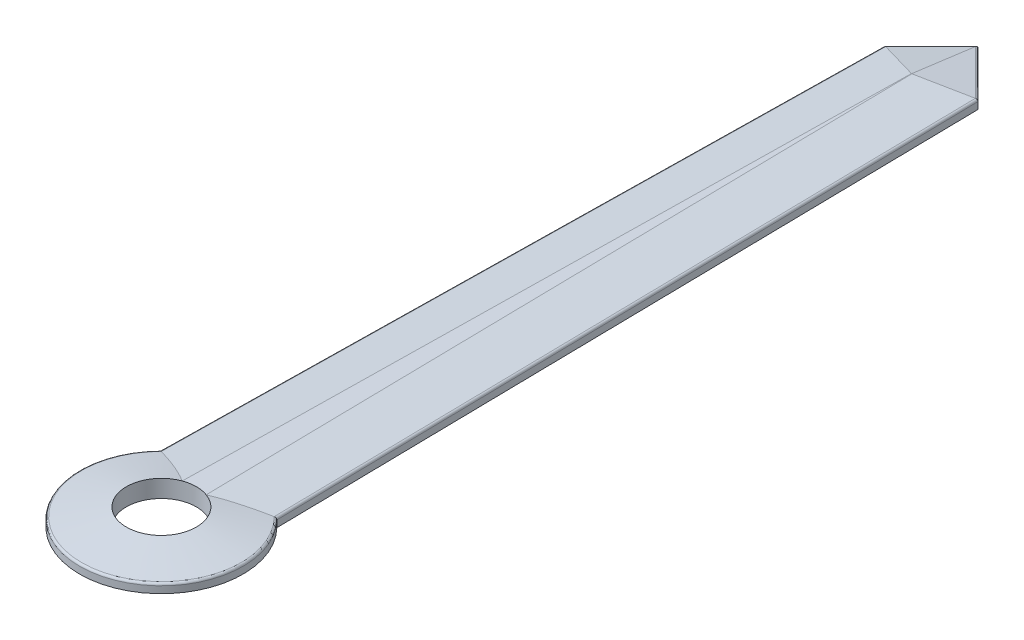
ISO-10303-21;
HEADER;
FILE_DESCRIPTION(('STEP AP214'),'2;1');
FILE_NAME('part.step','',(''),(''),'','','');
FILE_SCHEMA(('AUTOMOTIVE_DESIGN { 1 0 10303 214 1 1 1 1 }'));
ENDSEC;
DATA;
#1=APPLICATION_CONTEXT('core data for automotive mechanical design processes');
#2=APPLICATION_PROTOCOL_DEFINITION('international standard','automotive_design',2000,#1);
#3=PRODUCT_CONTEXT('',#1,'mechanical');
#4=PRODUCT('Part','Part','',(#3));
#5=PRODUCT_RELATED_PRODUCT_CATEGORY('part','',(#4));
#6=PRODUCT_DEFINITION_FORMATION('','',#4);
#7=PRODUCT_DEFINITION_CONTEXT('part definition',#1,'design');
#8=PRODUCT_DEFINITION('design','',#6,#7);
#9=PRODUCT_DEFINITION_SHAPE('','',#8);
#10=(LENGTH_UNIT() NAMED_UNIT(*) SI_UNIT(.MILLI.,.METRE.));
#11=(NAMED_UNIT(*) PLANE_ANGLE_UNIT() SI_UNIT($,.RADIAN.));
#12=(NAMED_UNIT(*) SI_UNIT($,.STERADIAN.) SOLID_ANGLE_UNIT());
#13=UNCERTAINTY_MEASURE_WITH_UNIT(LENGTH_MEASURE(1.E-05),#10,'distance_accuracy_value','');
#14=(GEOMETRIC_REPRESENTATION_CONTEXT(3) GLOBAL_UNCERTAINTY_ASSIGNED_CONTEXT((#13)) GLOBAL_UNIT_ASSIGNED_CONTEXT((#10,
#11,#12)) REPRESENTATION_CONTEXT('',''));
#15=CARTESIAN_POINT('',(0.,0.,0.));
#16=DIRECTION('',(0.,0.,1.));
#17=DIRECTION('',(1.,0.,0.));
#18=AXIS2_PLACEMENT_3D('',#15,#16,#17);
#19=CARTESIAN_POINT('',(0.,0.1905,0.));
#20=DIRECTION('',(0.,1.,0.));
#21=DIRECTION('',(0.,0.,1.));
#22=AXIS2_PLACEMENT_3D('',#19,#20,#21);
#23=PLANE('',#22);
#24=CARTESIAN_POINT('',(0.,0.1905,0.));
#25=DIRECTION('',(0.,1.,0.));
#26=DIRECTION('',(0.,0.,1.));
#27=AXIS2_PLACEMENT_3D('',#24,#25,#26);
#28=CIRCLE('',#27,0.380999999999999);
#29=CARTESIAN_POINT('',(0.130290982169233,0.1905,-0.358029691457812));
#30=VERTEX_POINT('',#29);
#31=CARTESIAN_POINT('',(-0.130290982169233,0.1905,-0.358029691457812));
#32=VERTEX_POINT('',#31);
#33=EDGE_CURVE('E149',#30,#32,#28,.T.);
#34=ORIENTED_EDGE('',*,*,#33,.F.);
#35=DIRECTION('',(-0.0163641472754282,0.,-0.999866098377152));
#36=VECTOR('',#35,1.);
#37=CARTESIAN_POINT('',(-0.000895722754283927,0.1905,-8.37367124021056));
#38=LINE('',#37,#36);
#39=CARTESIAN_POINT('',(0.00247458824657965,0.1905,-8.16774179860675));
#40=VERTEX_POINT('',#39);
#41=EDGE_CURVE('E181',#30,#40,#38,.T.);
#42=ORIENTED_EDGE('',*,*,#41,.T.);
#43=DIRECTION('',(-0.707106781186548,0.,-0.707106781186547));
#44=VECTOR('',#43,1.);
#45=CARTESIAN_POINT('',(-0.359891806573333,0.1905,-8.53010819342667));
#46=LINE('',#45,#44);
#47=CARTESIAN_POINT('',(0.,0.1905,-8.17021638685333));
#48=VERTEX_POINT('',#47);
#49=EDGE_CURVE('E178',#40,#48,#46,.T.);
#50=ORIENTED_EDGE('',*,*,#49,.T.);
#51=DIRECTION('',(-0.707106781186548,0.,0.707106781186547));
#52=VECTOR('',#51,1.);
#53=CARTESIAN_POINT('',(-0.148108193426666,0.1905,-8.02210819342667));
#54=LINE('',#53,#52);
#55=CARTESIAN_POINT('',(-0.00247458824657978,0.1905,-8.16774179860675));
#56=VERTEX_POINT('',#55);
#57=EDGE_CURVE('E176',#48,#56,#54,.T.);
#58=ORIENTED_EDGE('',*,*,#57,.T.);
#59=DIRECTION('',(-0.0163641472754282,0.,0.999866098377152));
#60=VECTOR('',#59,1.);
#61=CARTESIAN_POINT('',(-0.126104277245716,0.1905,-0.613841634877489));
#62=LINE('',#61,#60);
#63=EDGE_CURVE('E174',#56,#32,#62,.T.);
#64=ORIENTED_EDGE('',*,*,#63,.T.);
#65=EDGE_LOOP('',(#34,#42,#50,#58,#64));
#66=FACE_BOUND('',#65,.T.);
#67=ADVANCED_FACE('F34',(#66),#23,.T.);
#68=CARTESIAN_POINT('',(0.,0.,0.));
#69=DIRECTION('',(0.,1.,0.));
#70=DIRECTION('',(0.,0.,1.));
#71=AXIS2_PLACEMENT_3D('',#68,#69,#70);
#72=PLANE('',#71);
#73=CARTESIAN_POINT('',(0.,0.,0.));
#74=DIRECTION('',(0.,1.,0.));
#75=DIRECTION('',(0.,0.,1.));
#76=AXIS2_PLACEMENT_3D('',#73,#74,#75);
#77=CIRCLE('',#76,0.889);
#78=CARTESIAN_POINT('',(-0.635,0.,-0.622170394666927));
#79=VERTEX_POINT('',#78);
#80=CARTESIAN_POINT('',(0.635,0.,-0.622170394666927));
#81=VERTEX_POINT('',#80);
#82=EDGE_CURVE('E141',#79,#81,#77,.T.);
#83=ORIENTED_EDGE('',*,*,#82,.F.);
#84=DIRECTION('',(-0.0163641472754282,0.,0.999866098377152));
#85=VECTOR('',#84,1.);
#86=CARTESIAN_POINT('',(-0.635,0.,-0.622170394666927));
#87=LINE('',#86,#85);
#88=CARTESIAN_POINT('',(-0.508,0.,-8.382));
#89=VERTEX_POINT('',#88);
#90=EDGE_CURVE('E160',#89,#79,#87,.T.);
#91=ORIENTED_EDGE('',*,*,#90,.F.);
#92=DIRECTION('',(-0.707106781186548,0.,0.707106781186547));
#93=VECTOR('',#92,1.);
#94=CARTESIAN_POINT('',(-0.508,0.,-8.382));
#95=LINE('',#94,#93);
#96=CARTESIAN_POINT('',(0.,0.,-8.89));
#97=VERTEX_POINT('',#96);
#98=EDGE_CURVE('E157',#97,#89,#95,.T.);
#99=ORIENTED_EDGE('',*,*,#98,.F.);
#100=DIRECTION('',(-0.707106781186548,0.,-0.707106781186547));
#101=VECTOR('',#100,1.);
#102=CARTESIAN_POINT('',(0.,0.,-8.89));
#103=LINE('',#102,#101);
#104=CARTESIAN_POINT('',(0.508,0.,-8.382));
#105=VERTEX_POINT('',#104);
#106=EDGE_CURVE('E144',#105,#97,#103,.T.);
#107=ORIENTED_EDGE('',*,*,#106,.F.);
#108=DIRECTION('',(-0.0163641472754282,0.,-0.999866098377152));
#109=VECTOR('',#108,1.);
#110=CARTESIAN_POINT('',(0.508,0.,-8.382));
#111=LINE('',#110,#109);
#112=EDGE_CURVE('E128',#81,#105,#111,.T.);
#113=ORIENTED_EDGE('',*,*,#112,.F.);
#114=EDGE_LOOP('',(#83,#91,#99,#107,#113));
#115=FACE_BOUND('',#114,.T.);
#116=CARTESIAN_POINT('',(0.,0.,0.));
#117=DIRECTION('',(0.,1.,0.));
#118=DIRECTION('',(0.,0.,1.));
#119=AXIS2_PLACEMENT_3D('',#116,#117,#118);
#120=CIRCLE('',#119,0.380999999999999);
#121=CARTESIAN_POINT('',(0.,0.,0.380999999999999));
#122=VERTEX_POINT('',#121);
#123=EDGE_CURVE('E152',#122,#122,#120,.T.);
#124=ORIENTED_EDGE('',*,*,#123,.T.);
#125=EDGE_LOOP('',(#124));
#126=FACE_BOUND('',#125,.T.);
#127=ADVANCED_FACE('F138',(#115,#126),#72,.F.);
#128=CARTESIAN_POINT('',(0.,0.1905,0.));
#129=DIRECTION('',(0.,-1.,0.));
#130=DIRECTION('',(0.,0.,-1.));
#131=AXIS2_PLACEMENT_3D('',#128,#129,#130);
#132=CYLINDRICAL_SURFACE('',#131,0.889);
#133=DIRECTION('',(0.,-1.,0.));
#134=VECTOR('',#133,1.);
#135=CARTESIAN_POINT('',(0.635,0.1905,-0.622170394666927));
#136=LINE('',#135,#134);
#137=CARTESIAN_POINT('',(0.635,0.0741625137147924,-0.622170394666927));
#138=VERTEX_POINT('',#137);
#139=EDGE_CURVE('E124',#138,#81,#136,.T.);
#140=ORIENTED_EDGE('',*,*,#139,.F.);
#141=CARTESIAN_POINT('',(0.,0.0741625137147923,0.));
#142=DIRECTION('',(0.,1.,0.));
#143=DIRECTION('',(0.,0.,1.));
#144=AXIS2_PLACEMENT_3D('',#141,#142,#143);
#145=CIRCLE('',#144,0.889);
#146=CARTESIAN_POINT('',(-0.635,0.0741625137147924,-0.622170394666927));
#147=VERTEX_POINT('',#146);
#148=EDGE_CURVE('E48',#138,#147,#145,.F.);
#149=ORIENTED_EDGE('',*,*,#148,.T.);
#150=DIRECTION('',(0.,-1.,0.));
#151=VECTOR('',#150,1.);
#152=CARTESIAN_POINT('',(-0.635,0.1905,-0.622170394666927));
#153=LINE('',#152,#151);
#154=EDGE_CURVE('E147',#147,#79,#153,.T.);
#155=ORIENTED_EDGE('',*,*,#154,.T.);
#156=ORIENTED_EDGE('',*,*,#82,.T.);
#157=EDGE_LOOP('',(#140,#149,#155,#156));
#158=FACE_BOUND('',#157,.T.);
#159=ADVANCED_FACE('F146',(#158),#132,.T.);
#160=CARTESIAN_POINT('',(0.508,0.1905,-8.382));
#161=DIRECTION('',(-0.999866098377152,0.,0.0163641472754282));
#162=DIRECTION('',(0.0163641472754282,0.,0.999866098377152));
#163=AXIS2_PLACEMENT_3D('',#160,#161,#162);
#164=PLANE('',#163);
#165=DIRECTION('',(0.,-1.,0.));
#166=VECTOR('',#165,1.);
#167=CARTESIAN_POINT('',(0.508,0.1905,-8.382));
#168=LINE('',#167,#166);
#169=CARTESIAN_POINT('',(0.508,0.0741625137147924,-8.382));
#170=VERTEX_POINT('',#169);
#171=EDGE_CURVE('E134',#170,#105,#168,.T.);
#172=ORIENTED_EDGE('',*,*,#171,.F.);
#173=DIRECTION('',(0.0163641472754282,0.,0.999866098377152));
#174=VECTOR('',#173,1.);
#175=CARTESIAN_POINT('',(0.635,0.0741625137147924,-0.622170394666927));
#176=LINE('',#175,#174);
#177=EDGE_CURVE('E131',#170,#138,#176,.T.);
#178=ORIENTED_EDGE('',*,*,#177,.T.);
#179=ORIENTED_EDGE('',*,*,#139,.T.);
#180=ORIENTED_EDGE('',*,*,#112,.T.);
#181=EDGE_LOOP('',(#172,#178,#179,#180));
#182=FACE_BOUND('',#181,.T.);
#183=ADVANCED_FACE('F127',(#182),#164,.F.);
#184=CARTESIAN_POINT('',(0.,0.1905,-8.89));
#185=DIRECTION('',(-0.707106781186547,0.,0.707106781186548));
#186=DIRECTION('',(0.707106781186548,0.,0.707106781186547));
#187=AXIS2_PLACEMENT_3D('',#184,#185,#186);
#188=PLANE('',#187);
#189=DIRECTION('',(0.,-1.,0.));
#190=VECTOR('',#189,1.);
#191=CARTESIAN_POINT('',(0.,0.1905,-8.89));
#192=LINE('',#191,#190);
#193=CARTESIAN_POINT('',(0.,0.0741625137147924,-8.89));
#194=VERTEX_POINT('',#193);
#195=EDGE_CURVE('E165',#194,#97,#192,.T.);
#196=ORIENTED_EDGE('',*,*,#195,.F.);
#197=DIRECTION('',(0.707106781186548,0.,0.707106781186547));
#198=VECTOR('',#197,1.);
#199=CARTESIAN_POINT('',(0.508,0.0741625137147922,-8.382));
#200=LINE('',#199,#198);
#201=EDGE_CURVE('E184',#194,#170,#200,.T.);
#202=ORIENTED_EDGE('',*,*,#201,.T.);
#203=ORIENTED_EDGE('',*,*,#171,.T.);
#204=ORIENTED_EDGE('',*,*,#106,.T.);
#205=EDGE_LOOP('',(#196,#202,#203,#204));
#206=FACE_BOUND('',#205,.T.);
#207=ADVANCED_FACE('F290',(#206),#188,.F.);
#208=CARTESIAN_POINT('',(-0.508,0.1905,-8.382));
#209=DIRECTION('',(0.707106781186547,0.,0.707106781186548));
#210=DIRECTION('',(0.707106781186548,0.,-0.707106781186547));
#211=AXIS2_PLACEMENT_3D('',#208,#209,#210);
#212=PLANE('',#211);
#213=DIRECTION('',(0.,-1.,0.));
#214=VECTOR('',#213,1.);
#215=CARTESIAN_POINT('',(-0.508,0.1905,-8.382));
#216=LINE('',#215,#214);
#217=CARTESIAN_POINT('',(-0.508,0.0741625137147924,-8.382));
#218=VERTEX_POINT('',#217);
#219=EDGE_CURVE('E163',#218,#89,#216,.T.);
#220=ORIENTED_EDGE('',*,*,#219,.F.);
#221=DIRECTION('',(0.707106781186548,0.,-0.707106781186547));
#222=VECTOR('',#221,1.);
#223=CARTESIAN_POINT('',(0.,0.0741625137147922,-8.89));
#224=LINE('',#223,#222);
#225=EDGE_CURVE('E272',#218,#194,#224,.T.);
#226=ORIENTED_EDGE('',*,*,#225,.T.);
#227=ORIENTED_EDGE('',*,*,#195,.T.);
#228=ORIENTED_EDGE('',*,*,#98,.T.);
#229=EDGE_LOOP('',(#220,#226,#227,#228));
#230=FACE_BOUND('',#229,.T.);
#231=ADVANCED_FACE('F288',(#230),#212,.F.);
#232=CARTESIAN_POINT('',(-0.635,0.1905,-0.622170394666927));
#233=DIRECTION('',(0.999866098377152,0.,0.0163641472754282));
#234=DIRECTION('',(0.0163641472754282,0.,-0.999866098377152));
#235=AXIS2_PLACEMENT_3D('',#232,#233,#234);
#236=PLANE('',#235);
#237=ORIENTED_EDGE('',*,*,#154,.F.);
#238=DIRECTION('',(0.0163641472754282,0.,-0.999866098377152));
#239=VECTOR('',#238,1.);
#240=CARTESIAN_POINT('',(-0.508,0.0741625137147924,-8.382));
#241=LINE('',#240,#239);
#242=EDGE_CURVE('E252',#147,#218,#241,.T.);
#243=ORIENTED_EDGE('',*,*,#242,.T.);
#244=ORIENTED_EDGE('',*,*,#219,.T.);
#245=ORIENTED_EDGE('',*,*,#90,.T.);
#246=EDGE_LOOP('',(#237,#243,#244,#245));
#247=FACE_BOUND('',#246,.T.);
#248=ADVANCED_FACE('F291',(#247),#236,.F.);
#249=CARTESIAN_POINT('',(0.,0.1905,0.));
#250=DIRECTION('',(0.,-1.,0.));
#251=DIRECTION('',(0.,0.,-1.));
#252=AXIS2_PLACEMENT_3D('',#249,#250,#251);
#253=CYLINDRICAL_SURFACE('',#252,0.380999999999999);
#254=CARTESIAN_POINT('',(0.,0.190319615913308,0.));
#255=DIRECTION('',(0.,-1.,0.));
#256=DIRECTION('',(0.,0.,-1.));
#257=AXIS2_PLACEMENT_3D('',#254,#255,#256);
#258=CIRCLE('',#257,0.380999999999999);
#259=CARTESIAN_POINT('',(-0.131260785505618,0.190319615913316,-0.357675280370964));
#260=VERTEX_POINT('',#259);
#261=CARTESIAN_POINT('',(0.131260785505618,0.190319615913308,-0.357675280370964));
#262=VERTEX_POINT('',#261);
#263=EDGE_CURVE('E169',#260,#262,#258,.F.);
#264=ORIENTED_EDGE('',*,*,#263,.T.);
#265=CARTESIAN_POINT('',(0.,0.215976483675146,0.));
#266=DIRECTION('',(0.183926719228348,0.982935349149554,-0.00301020699294048));
#267=DIRECTION('',(0.982803732511148,-0.18395135061272,-0.0160848988157077));
#268=AXIS2_PLACEMENT_3D('',#265,#266,#267);
#269=ELLIPSE('',#268,0.387614506213094,0.380999999999999);
#270=EDGE_CURVE('E172',#262,#30,#269,.T.);
#271=ORIENTED_EDGE('',*,*,#270,.T.);
#272=ORIENTED_EDGE('',*,*,#33,.T.);
#273=CARTESIAN_POINT('',(0.,0.215976483675146,0.));
#274=DIRECTION('',(-0.183926719228348,0.982935349149554,-0.00301020699294048));
#275=DIRECTION('',(-0.982803732511148,-0.18395135061272,-0.0160848988157078));
#276=AXIS2_PLACEMENT_3D('',#273,#274,#275);
#277=ELLIPSE('',#276,0.387614506213094,0.380999999999999);
#278=EDGE_CURVE('E133',#32,#260,#277,.T.);
#279=ORIENTED_EDGE('',*,*,#278,.T.);
#280=EDGE_LOOP('',(#264,#271,#272,#279));
#281=FACE_BOUND('',#280,.T.);
#282=ORIENTED_EDGE('',*,*,#123,.F.);
#283=EDGE_LOOP('',(#282));
#284=FACE_BOUND('',#283,.T.);
#285=ADVANCED_FACE('F217',(#281,#284),#253,.F.);
#286=CARTESIAN_POINT('',(-4.08510819342667,0.1905,-4.08510819342667));
#287=DIRECTION('',(-0.130073247426679,0.982935349149554,-0.130073247426679));
#288=DIRECTION('',(0.,0.13118776787575,0.991357538711326));
#289=AXIS2_PLACEMENT_3D('',#286,#287,#288);
#290=PLANE('',#289);
#291=DIRECTION('',(0.,-0.13118776787575,-0.991357538711326));
#292=VECTOR('',#291,1.);
#293=CARTESIAN_POINT('',(0.,0.721784590194362,-4.15541384680878));
#294=LINE('',#293,#292);
#295=CARTESIAN_POINT('',(0.,0.099129071583191,-8.860686696485));
#296=VERTEX_POINT('',#295);
#297=EDGE_CURVE('E276',#296,#48,#294,.F.);
#298=ORIENTED_EDGE('',*,*,#297,.F.);
#299=DIRECTION('',(0.707106781186548,0.,-0.707106781186547));
#300=VECTOR('',#299,1.);
#301=CARTESIAN_POINT('',(-0.493343348242499,0.0991290715831909,-8.3673433482425));
#302=LINE('',#301,#300);
#303=CARTESIAN_POINT('',(-0.487412396227678,0.0991290715831911,-8.37327430025732));
#304=VERTEX_POINT('',#303);
#305=EDGE_CURVE('E269',#296,#304,#302,.F.);
#306=ORIENTED_EDGE('',*,*,#305,.T.);
#307=DIRECTION('',(-0.907167863131854,-0.170926598256659,-0.384487406957877));
#308=VECTOR('',#307,1.);
#309=CARTESIAN_POINT('',(2.73563364095255,0.706408404933815,-7.00724198837286));
#310=LINE('',#309,#308);
#311=EDGE_CURVE('E280',#56,#304,#310,.T.);
#312=ORIENTED_EDGE('',*,*,#311,.F.);
#313=ORIENTED_EDGE('',*,*,#57,.F.);
#314=EDGE_LOOP('',(#298,#306,#312,#313));
#315=FACE_BOUND('',#314,.T.);
#316=ADVANCED_FACE('F213',(#315),#290,.T.);
#317=CARTESIAN_POINT('',(4.08510819342667,0.1905,-4.08510819342667));
#318=DIRECTION('',(0.130073247426679,0.982935349149554,-0.130073247426679));
#319=DIRECTION('',(0.,0.13118776787575,0.991357538711326));
#320=AXIS2_PLACEMENT_3D('',#317,#318,#319);
#321=PLANE('',#320);
#322=DIRECTION('',(0.907167863131854,-0.170926598256659,-0.384487406957878));
#323=VECTOR('',#322,1.);
#324=CARTESIAN_POINT('',(1.93829169872956,-0.174242455050791,-8.98820439588696));
#325=LINE('',#324,#323);
#326=CARTESIAN_POINT('',(0.487412396227678,0.099129071583191,-8.37327430025732));
#327=VERTEX_POINT('',#326);
#328=EDGE_CURVE('E277',#327,#40,#325,.F.);
#329=ORIENTED_EDGE('',*,*,#328,.F.);
#330=DIRECTION('',(0.707106781186548,0.,0.707106781186547));
#331=VECTOR('',#330,1.);
#332=CARTESIAN_POINT('',(-0.0146566517575008,0.0991290715831909,-8.8753433482425));
#333=LINE('',#332,#331);
#334=EDGE_CURVE('E267',#327,#296,#333,.F.);
#335=ORIENTED_EDGE('',*,*,#334,.T.);
#336=ORIENTED_EDGE('',*,*,#297,.T.);
#337=ORIENTED_EDGE('',*,*,#49,.F.);
#338=EDGE_LOOP('',(#329,#335,#336,#337));
#339=FACE_BOUND('',#338,.T.);
#340=ADVANCED_FACE('F210',(#339),#321,.T.);
#341=CARTESIAN_POINT('',(-0.136114158247782,0.1905,-0.00222769042320052));
#342=DIRECTION('',(-0.183926719228348,0.982935349149554,-0.00301020699294048));
#343=DIRECTION('',(-0.982939802538536,-0.183927552545845,0.));
#344=AXIS2_PLACEMENT_3D('',#341,#342,#343);
#345=PLANE('',#344);
#346=ORIENTED_EDGE('',*,*,#311,.T.);
#347=DIRECTION('',(0.0163641472754282,0.,-0.999866098377152));
#348=VECTOR('',#347,1.);
#349=CARTESIAN_POINT('',(-0.61427513976962,0.0991290715831911,-0.621831204583752));
#350=LINE('',#349,#348);
#351=CARTESIAN_POINT('',(-0.61441131251624,0.0991290715831926,-0.613510910798519));
#352=VERTEX_POINT('',#351);
#353=EDGE_CURVE('E56',#304,#352,#350,.F.);
#354=ORIENTED_EDGE('',*,*,#353,.T.);
#355=CARTESIAN_POINT('',(-1.47147255137392,-0.0621517655911384,-0.909893903828372));
#356=CARTESIAN_POINT('',(-1.40126561664907,-0.0489516430604869,-0.88931861528272));
#357=CARTESIAN_POINT('',(-1.33123256726205,-0.0357822712731719,-0.868159922647089));
#358=CARTESIAN_POINT('',(-1.19155517359173,-0.00951179945482843,-0.824385318027376));
#359=CARTESIAN_POINT('',(-1.12191114060924,0.00358924546163034,-0.801768382035371));
#360=CARTESIAN_POINT('',(-0.91180737219843,0.0431215576781161,-0.730673507034872));
#361=CARTESIAN_POINT('',(-0.772172257976581,0.0694067199513363,-0.679518649929991));
#362=CARTESIAN_POINT('',(-0.560869877669018,0.109216129447022,-0.591178463493681));
#363=CARTESIAN_POINT('',(-0.487459031921342,0.123053207294985,-0.558377751854708));
#364=CARTESIAN_POINT('',(-0.343527602704058,0.150202761355517,-0.487478697250913));
#365=CARTESIAN_POINT('',(-0.272995184279456,0.163517374645867,-0.449405653260168));
#366=CARTESIAN_POINT('',(-0.149537241978278,0.186855719724566,-0.372045498655669));
#367=CARTESIAN_POINT('',(-0.0957633088371803,0.197033555626133,-0.334276805966505));
#368=CARTESIAN_POINT('',(-0.021155913531705,0.211192563180673,-0.2694654537962));
#369=CARTESIAN_POINT('',(0.00286274626934901,0.215757892030189,-0.246294353145887));
#370=CARTESIAN_POINT('',(0.046850909684194,0.224142164765649,-0.196264748147143));
#371=CARTESIAN_POINT('',(0.0668457581203295,0.227965774640298,-0.169431233703665));
#372=CARTESIAN_POINT('',(0.0904704545488148,0.232515842293267,-0.127171870621056));
#373=CARTESIAN_POINT('',(0.0970812378010598,0.233794733459666,-0.113495847626509));
#374=CARTESIAN_POINT('',(0.108231955058883,0.23596765023619,-0.0852845424472507));
#375=CARTESIAN_POINT('',(0.112773698416452,0.236862012074228,-0.0707500236230778));
#376=CARTESIAN_POINT('',(0.119326509505099,0.23817953496342,-0.0409172659247494));
#377=CARTESIAN_POINT('',(0.121310138991908,0.238597581619502,-0.0256125469164558));
#378=CARTESIAN_POINT('',(0.122346333093547,0.23888548850571,0.0050863632700086));
#379=CARTESIAN_POINT('',(0.121403083838638,0.238756131556419,0.0204803952626585));
#380=CARTESIAN_POINT('',(0.116963744366099,0.238013338117826,0.0491811513962582));
#381=CARTESIAN_POINT('',(0.113750978057984,0.237453062228181,0.0625352461760626));
#382=CARTESIAN_POINT('',(0.105382207931775,0.235967093264305,0.0886560448923355));
#383=CARTESIAN_POINT('',(0.100217020058462,0.235039672173734,0.101419647647132));
#384=CARTESIAN_POINT('',(0.0846088482750408,0.2322186806122,0.133944820840169));
#385=CARTESIAN_POINT('',(0.0728899550909656,0.230084371444411,0.153056346869973));
#386=CARTESIAN_POINT('',(0.04690333013583,0.225331855140782,0.189006831279379));
#387=CARTESIAN_POINT('',(0.0326746133775238,0.222721036354855,0.205874481043181));
#388=CARTESIAN_POINT('',(0.017766486995649,0.219980200210557,0.221799645962157));
#389=B_SPLINE_CURVE_WITH_KNOTS('',3,(#355,#356,#357,#358,#359,#360,#361,#362,#363,#364,#365,
#366,#367,#368,#369,#370,#371,#372,#373,#374,#375,#376,#377,#378,#379,#380,#381,#382,#383,#384,
#385,#386,#387,#388),.UNSPECIFIED.,.F.,.F.,(4,2,2,2,2,2,2,2,2,2,2,2,2,2,2,2,4),(0.,
0.223001286945015,0.446160912348124,0.898804041303776,1.14341976037625,1.38689994820208,
1.58548346483561,1.68631638916805,1.78649281752304,1.83209118392024,1.87764959815471,
1.9236927138026,1.96967000725155,2.01073823503396,2.05200209870585,2.11922986502013,
2.18549230719106),.UNSPECIFIED.);
#390=EDGE_CURVE('E192',#260,#352,#389,.F.);
#391=ORIENTED_EDGE('',*,*,#390,.F.);
#392=ORIENTED_EDGE('',*,*,#278,.F.);
#393=ORIENTED_EDGE('',*,*,#63,.F.);
#394=EDGE_LOOP('',(#346,#354,#391,#392,#393));
#395=FACE_BOUND('',#394,.T.);
#396=ADVANCED_FACE('F205',(#395),#345,.T.);
#397=CARTESIAN_POINT('',(0.136114158247782,0.1905,-0.00222769042320051));
#398=DIRECTION('',(0.183926719228348,0.982935349149554,-0.00301020699294048));
#399=DIRECTION('',(-0.982939802538536,0.183927552545845,0.));
#400=AXIS2_PLACEMENT_3D('',#397,#398,#399);
#401=PLANE('',#400);
#402=CARTESIAN_POINT('',(1.47147255137392,-0.0621517655911384,-0.909893903828373));
#403=CARTESIAN_POINT('',(1.40126561664907,-0.0489516430604868,-0.88931861528272));
#404=CARTESIAN_POINT('',(1.33123256726205,-0.0357822712731718,-0.868159922647089));
#405=CARTESIAN_POINT('',(1.19155517359173,-0.0095117994548283,-0.824385318027376));
#406=CARTESIAN_POINT('',(1.12191114060923,0.00358924546163044,-0.801768382035371));
#407=CARTESIAN_POINT('',(0.91180737219843,0.0431215576781161,-0.730673507034872));
#408=CARTESIAN_POINT('',(0.772172257976581,0.0694067199513363,-0.679518649929991));
#409=CARTESIAN_POINT('',(0.560869877669018,0.109216129447022,-0.591178463493681));
#410=CARTESIAN_POINT('',(0.487459031921342,0.123053207294985,-0.558377751854708));
#411=CARTESIAN_POINT('',(0.343527602704058,0.150202761355517,-0.487478697250913));
#412=CARTESIAN_POINT('',(0.272995184279456,0.163517374645867,-0.449405653260168));
#413=CARTESIAN_POINT('',(0.149537241978278,0.186855719724566,-0.372045498655669));
#414=CARTESIAN_POINT('',(0.0957633088371803,0.197033555626133,-0.334276805966505));
#415=CARTESIAN_POINT('',(0.021155913531705,0.211192563180673,-0.2694654537962));
#416=CARTESIAN_POINT('',(-0.00286274626934911,0.215757892030189,-0.246294353145887));
#417=CARTESIAN_POINT('',(-0.0468509096841942,0.224142164765649,-0.196264748147143));
#418=CARTESIAN_POINT('',(-0.0668457581203296,0.227965774640298,-0.169431233703665));
#419=CARTESIAN_POINT('',(-0.0904704545488149,0.232515842293267,-0.127171870621056));
#420=CARTESIAN_POINT('',(-0.0970812378010599,0.233794733459666,-0.113495847626509));
#421=CARTESIAN_POINT('',(-0.108231955058884,0.23596765023619,-0.0852845424472503));
#422=CARTESIAN_POINT('',(-0.112773698416452,0.236862012074228,-0.0707500236230774));
#423=CARTESIAN_POINT('',(-0.119326509505099,0.23817953496342,-0.0409172659247491));
#424=CARTESIAN_POINT('',(-0.121310138991908,0.238597581619502,-0.0256125469164555));
#425=CARTESIAN_POINT('',(-0.122346333093547,0.23888548850571,0.0050863632700088));
#426=CARTESIAN_POINT('',(-0.121403083838638,0.238756131556419,0.0204803952626587));
#427=CARTESIAN_POINT('',(-0.116963744366099,0.238013338117826,0.0491811513962584));
#428=CARTESIAN_POINT('',(-0.113750978057984,0.237453062228181,0.0625352461760627));
#429=CARTESIAN_POINT('',(-0.105382207931775,0.235967093264305,0.0886560448923356));
#430=CARTESIAN_POINT('',(-0.100217020058462,0.235039672173734,0.101419647647132));
#431=CARTESIAN_POINT('',(-0.0846088482750408,0.2322186806122,0.133944820840169));
#432=CARTESIAN_POINT('',(-0.0728899550909655,0.230084371444411,0.153056346869973));
#433=CARTESIAN_POINT('',(-0.04690333013583,0.225331855140782,0.189006831279379));
#434=CARTESIAN_POINT('',(-0.0326746133775237,0.222721036354855,0.205874481043181));
#435=CARTESIAN_POINT('',(-0.017766486995649,0.219980200210557,0.221799645962157));
#436=B_SPLINE_CURVE_WITH_KNOTS('',3,(#402,#403,#404,#405,#406,#407,#408,#409,#410,#411,#412,
#413,#414,#415,#416,#417,#418,#419,#420,#421,#422,#423,#424,#425,#426,#427,#428,#429,#430,#431,
#432,#433,#434,#435),.UNSPECIFIED.,.F.,.F.,(4,2,2,2,2,2,2,2,2,2,2,2,2,2,2,2,4),(0.,
0.223001286945015,0.446160912348125,0.898804041303776,1.14341976037625,1.38689994820208,
1.58548346483561,1.68631638916805,1.78649281752304,1.83209118392024,1.87764959815471,
1.9236927138026,1.96967000725155,2.01073823503396,2.05200209870585,2.11922986502013,
2.18549230719106),.UNSPECIFIED.);
#437=CARTESIAN_POINT('',(0.614411312516249,0.099129071583191,-0.613510910798523));
#438=VERTEX_POINT('',#437);
#439=EDGE_CURVE('E185',#438,#262,#436,.T.);
#440=ORIENTED_EDGE('',*,*,#439,.F.);
#441=DIRECTION('',(0.0163641472754282,0.,0.999866098377152));
#442=VECTOR('',#441,1.);
#443=CARTESIAN_POINT('',(0.487275139769621,0.0991290715831911,-8.38166080991682));
#444=LINE('',#443,#442);
#445=EDGE_CURVE('E255',#438,#327,#444,.F.);
#446=ORIENTED_EDGE('',*,*,#445,.T.);
#447=ORIENTED_EDGE('',*,*,#328,.T.);
#448=ORIENTED_EDGE('',*,*,#41,.F.);
#449=ORIENTED_EDGE('',*,*,#270,.F.);
#450=EDGE_LOOP('',(#440,#446,#447,#448,#449));
#451=FACE_BOUND('',#450,.T.);
#452=ADVANCED_FACE('F198',(#451),#401,.T.);
#453=CARTESIAN_POINT('',(0.,0.1905,0.));
#454=DIRECTION('',(0.,-1.,0.));
#455=DIRECTION('',(0.,0.,-1.));
#456=AXIS2_PLACEMENT_3D('',#453,#454,#455);
#457=CONICAL_SURFACE('',#456,0.380036126157037,1.3857914260835);
#458=ORIENTED_EDGE('',*,*,#390,.T.);
#459=CARTESIAN_POINT('',(0.,0.0991290715831915,0.));
#460=DIRECTION('',(0.,-1.,0.));
#461=DIRECTION('',(0.,0.,-1.));
#462=AXIS2_PLACEMENT_3D('',#459,#460,#461);
#463=CIRCLE('',#462,0.868272364305563);
#464=EDGE_CURVE('E11',#352,#438,#463,.F.);
#465=ORIENTED_EDGE('',*,*,#464,.T.);
#466=ORIENTED_EDGE('',*,*,#439,.T.);
#467=ORIENTED_EDGE('',*,*,#263,.F.);
#468=EDGE_LOOP('',(#458,#465,#466,#467));
#469=FACE_BOUND('',#468,.T.);
#470=ADVANCED_FACE('F201',(#469),#457,.T.);
#471=CARTESIAN_POINT('',(-0.60960340110122,0.0741625137147924,-0.621754745326131));
#472=DIRECTION('',(-0.0163641472754282,0.,0.999866098377152));
#473=DIRECTION('',(0.999866098377152,0.,0.0163641472754282));
#474=AXIS2_PLACEMENT_3D('',#471,#472,#473);
#475=CYLINDRICAL_SURFACE('',#474,0.0254);
#476=CARTESIAN_POINT('',(-0.482771597517158,0.0741625137147923,-8.37130737799856));
#477=DIRECTION('',(-0.390230125096571,0.,0.920717355906314));
#478=DIRECTION('',(0.920717355906314,0.,0.390230125096571));
#479=AXIS2_PLACEMENT_3D('',#476,#477,#478);
#480=ELLIPSE('',#479,0.027400811248973,0.0254);
#481=EDGE_CURVE('E237',#218,#304,#480,.F.);
#482=ORIENTED_EDGE('',*,*,#481,.F.);
#483=ORIENTED_EDGE('',*,*,#242,.F.);
#484=CARTESIAN_POINT('',(-0.614411312516244,0.0991290715831918,-0.613510910798521));
#485=CARTESIAN_POINT('',(-0.615855504745691,0.0988578641837582,-0.614122412033887));
#486=CARTESIAN_POINT('',(-0.617280206082518,0.0984570881369223,-0.614724736716265));
#487=CARTESIAN_POINT('',(-0.620053605301677,0.0974046681741702,-0.615895732709027));
#488=CARTESIAN_POINT('',(-0.621402078397223,0.0967523225803079,-0.616464304711751));
#489=CARTESIAN_POINT('',(-0.623979632369687,0.0952053386043514,-0.617549798332686));
#490=CARTESIAN_POINT('',(-0.625208504409013,0.0943102863885974,-0.618066629649018));
#491=CARTESIAN_POINT('',(-0.627499370321241,0.092298405710771,-0.619029111274167));
#492=CARTESIAN_POINT('',(-0.628561591374638,0.0911818839468188,-0.619474858499512));
#493=CARTESIAN_POINT('',(-0.630427891918803,0.0888184052931962,-0.620257377039656));
#494=CARTESIAN_POINT('',(-0.631242554949452,0.0875813043809572,-0.620598623550746));
#495=CARTESIAN_POINT('',(-0.632651251667104,0.0849669448361767,-0.621188358472887));
#496=CARTESIAN_POINT('',(-0.633245369034806,0.0835897396160308,-0.62143688206558));
#497=CARTESIAN_POINT('',(-0.634137117005031,0.0808847069788856,-0.621809785488046));
#498=CARTESIAN_POINT('',(-0.634458802933769,0.0795661646979716,-0.621944240194083));
#499=CARTESIAN_POINT('',(-0.63489117880377,0.076886377341871,-0.622124926170165));
#500=CARTESIAN_POINT('',(-0.635001430429763,0.0755250494909945,-0.622170974168326));
#501=CARTESIAN_POINT('',(-0.635000000044382,0.0741625137322058,-0.622170394687084));
#502=B_SPLINE_CURVE_WITH_KNOTS('',3,(#484,#485,#486,#487,#488,#489,#490,#491,#492,#493,#494,
#495,#496,#497,#498,#499,#500,#501),.UNSPECIFIED.,.F.,.F.,(4,2,2,2,2,2,2,2,4),(0.,
0.00477095699539063,0.00955531853388507,0.0143478896415343,0.0191338696051785,
0.0236699260775635,0.0282042596899899,0.0322762238796967,0.0363566203948863),.UNSPECIFIED.);
#503=EDGE_CURVE('E39',#352,#147,#502,.T.);
#504=ORIENTED_EDGE('',*,*,#503,.F.);
#505=ORIENTED_EDGE('',*,*,#353,.F.);
#506=EDGE_LOOP('',(#482,#483,#504,#505));
#507=FACE_BOUND('',#506,.T.);
#508=ADVANCED_FACE('F36',(#507),#475,.T.);
#509=CARTESIAN_POINT('',(0.,0.0741625137147923,0.));
#510=DIRECTION('',(0.,1.,0.));
#511=DIRECTION('',(0.,0.,1.));
#512=AXIS2_PLACEMENT_3D('',#509,#510,#511);
#513=TOROIDAL_SURFACE('',#512,0.8636,0.0254);
#514=ORIENTED_EDGE('',*,*,#503,.T.);
#515=ORIENTED_EDGE('',*,*,#148,.F.);
#516=CARTESIAN_POINT('',(0.635,0.0741625137147924,-0.622170394666927));
#517=CARTESIAN_POINT('',(0.635001494325591,0.07551809218073,-0.622171001162093));
#518=CARTESIAN_POINT('',(0.63489230636332,0.0768727255445426,-0.622125397266721));
#519=CARTESIAN_POINT('',(0.634464236346081,0.0795389615351297,-0.621946510998784));
#520=CARTESIAN_POINT('',(0.634145908213204,0.0808506682481975,-0.621813460234897));
#521=CARTESIAN_POINT('',(0.633311199413417,0.08339720923481,-0.621464411792394));
#522=CARTESIAN_POINT('',(0.632794857478648,0.0846320584870539,-0.621248430335279));
#523=CARTESIAN_POINT('',(0.631583718292565,0.0869941042753445,-0.620741479164581));
#524=CARTESIAN_POINT('',(0.630888872905967,0.088121271661223,-0.620450489224121));
#525=CARTESIAN_POINT('',(0.629321687546514,0.0902730447626433,-0.619793637325921));
#526=CARTESIAN_POINT('',(0.628444790477159,0.0912937354378698,-0.619425851288461));
#527=CARTESIAN_POINT('',(0.62655433572618,0.0931736458934321,-0.618632180478572));
#528=CARTESIAN_POINT('',(0.625540695209363,0.0940327670385129,-0.618206260488434));
#529=CARTESIAN_POINT('',(0.623332881457135,0.0956267556058752,-0.617277548861883));
#530=CARTESIAN_POINT('',(0.622131118864066,0.0963492000318741,-0.616771499315864));
#531=CARTESIAN_POINT('',(0.619639966265064,0.0975799029834918,-0.615721170024663));
#532=CARTESIAN_POINT('',(0.618350666352798,0.0980883779598293,-0.615176929566887));
#533=CARTESIAN_POINT('',(0.6161699511085,0.0987486425713385,-0.614255197358504));
#534=CARTESIAN_POINT('',(0.615294133024222,0.0989629596305378,-0.613884704386255));
#535=CARTESIAN_POINT('',(0.614411312516254,0.09912907158319,-0.613510910798525));
#536=B_SPLINE_CURVE_WITH_KNOTS('',3,(#516,#517,#518,#519,#520,#521,#522,#523,#524,#525,#526,
#527,#528,#529,#530,#531,#532,#533,#534,#535),.UNSPECIFIED.,.F.,.F.,(4,2,2,2,2,2,2,2,2,4),(0.,
0.00406011754097741,0.00810952469981866,0.0121581401851923,0.0162078485692884,
0.0203748249219063,0.0245443369380715,0.0289973959524856,0.0334459393760214,0.0363651033581965),.UNSPECIFIED.);
#537=EDGE_CURVE('E231',#438,#138,#536,.F.);
#538=ORIENTED_EDGE('',*,*,#537,.F.);
#539=ORIENTED_EDGE('',*,*,#464,.F.);
#540=EDGE_LOOP('',(#514,#515,#538,#539));
#541=FACE_BOUND('',#540,.T.);
#542=ADVANCED_FACE('F228',(#541),#513,.T.);
#543=CARTESIAN_POINT('',(-0.490039487757862,0.0741625137147922,-8.36403948775786));
#544=DIRECTION('',(-0.707106781186548,0.,0.707106781186547));
#545=DIRECTION('',(0.707106781186547,0.,0.707106781186548));
#546=AXIS2_PLACEMENT_3D('',#543,#544,#545);
#547=CYLINDRICAL_SURFACE('',#546,0.0254);
#548=ORIENTED_EDGE('',*,*,#481,.T.);
#549=ORIENTED_EDGE('',*,*,#305,.F.);
#550=CARTESIAN_POINT('',(0.,0.0741625137147922,-8.85407897551572));
#551=DIRECTION('',(-1.,0.,0.));
#552=DIRECTION('',(0.,0.,1.));
#553=AXIS2_PLACEMENT_3D('',#550,#551,#552);
#554=ELLIPSE('',#553,0.0359210244842766,0.0254);
#555=EDGE_CURVE('E238',#194,#296,#554,.F.);
#556=ORIENTED_EDGE('',*,*,#555,.F.);
#557=ORIENTED_EDGE('',*,*,#225,.F.);
#558=EDGE_LOOP('',(#548,#549,#556,#557));
#559=FACE_BOUND('',#558,.T.);
#560=ADVANCED_FACE('F226',(#559),#547,.T.);
#561=CARTESIAN_POINT('',(0.482603401101221,0.0741625137147924,-8.3815843506592));
#562=DIRECTION('',(-0.0163641472754282,0.,-0.999866098377152));
#563=DIRECTION('',(-0.999866098377152,0.,0.0163641472754282));
#564=AXIS2_PLACEMENT_3D('',#561,#562,#563);
#565=CYLINDRICAL_SURFACE('',#564,0.0254);
#566=ORIENTED_EDGE('',*,*,#537,.T.);
#567=ORIENTED_EDGE('',*,*,#177,.F.);
#568=CARTESIAN_POINT('',(0.482771597517158,0.0741625137147923,-8.37130737799856));
#569=DIRECTION('',(-0.390230125096571,0.,-0.920717355906314));
#570=DIRECTION('',(0.920717355906314,0.,-0.390230125096571));
#571=AXIS2_PLACEMENT_3D('',#568,#569,#570);
#572=ELLIPSE('',#571,0.027400811248973,0.0254);
#573=EDGE_CURVE('E261',#327,#170,#572,.T.);
#574=ORIENTED_EDGE('',*,*,#573,.F.);
#575=ORIENTED_EDGE('',*,*,#445,.F.);
#576=EDGE_LOOP('',(#566,#567,#574,#575));
#577=FACE_BOUND('',#576,.T.);
#578=ADVANCED_FACE('F222',(#577),#565,.T.);
#579=CARTESIAN_POINT('',(-0.0179605122421383,0.0741625137147922,-8.87203948775786));
#580=DIRECTION('',(-0.707106781186548,0.,-0.707106781186547));
#581=DIRECTION('',(-0.707106781186547,0.,0.707106781186548));
#582=AXIS2_PLACEMENT_3D('',#579,#580,#581);
#583=CYLINDRICAL_SURFACE('',#582,0.0254);
#584=ORIENTED_EDGE('',*,*,#555,.T.);
#585=ORIENTED_EDGE('',*,*,#334,.F.);
#586=ORIENTED_EDGE('',*,*,#573,.T.);
#587=ORIENTED_EDGE('',*,*,#201,.F.);
#588=EDGE_LOOP('',(#584,#585,#586,#587));
#589=FACE_BOUND('',#588,.T.);
#590=ADVANCED_FACE('F219',(#589),#583,.T.);
#591=CLOSED_SHELL('',(#67,#127,#159,#183,#207,#231,#248,#285,#316,#340,#396,#452,#470,#508,#542,
#560,#578,#590));
#592=MANIFOLD_SOLID_BREP('B2',#591);
#593=ADVANCED_BREP_SHAPE_REPRESENTATION('',(#18,#592),#14);
#594=SHAPE_DEFINITION_REPRESENTATION(#9,#593);
ENDSEC;
END-ISO-10303-21;
